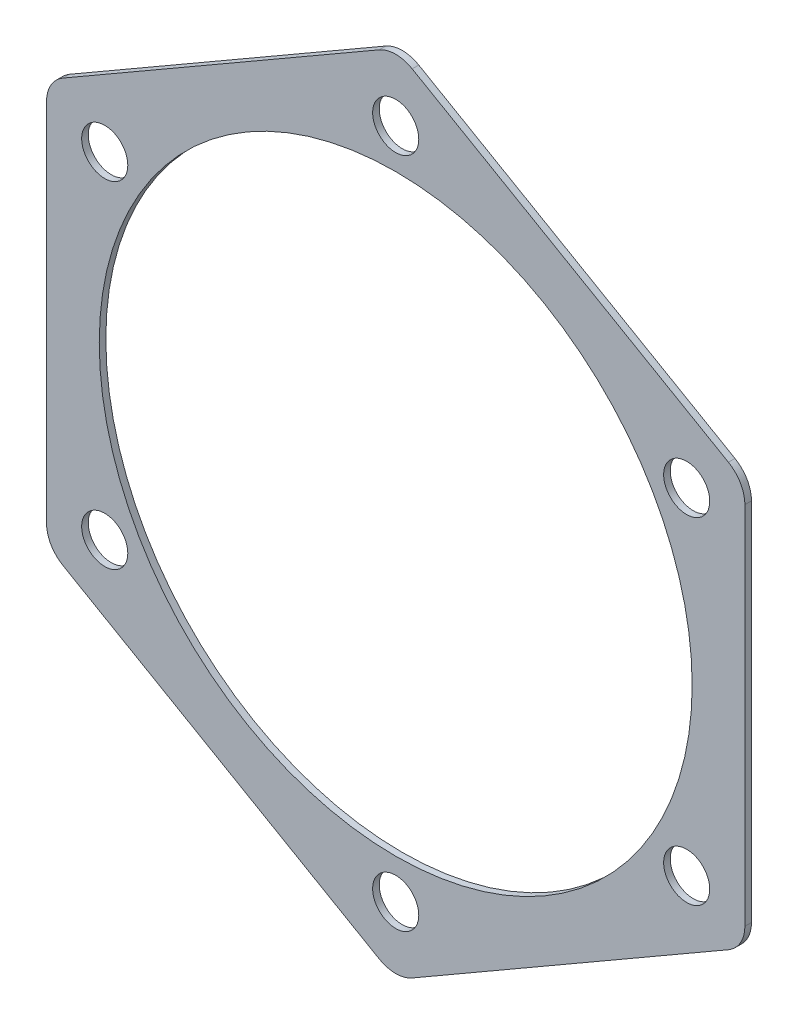
ISO-10303-21;
HEADER;
FILE_DESCRIPTION(('STEP AP214'),'2;1');
FILE_NAME('part.step','',(''),(''),'','','');
FILE_SCHEMA(('AUTOMOTIVE_DESIGN { 1 0 10303 214 1 1 1 1 }'));
ENDSEC;
DATA;
#1=APPLICATION_CONTEXT('core data for automotive mechanical design processes');
#2=APPLICATION_PROTOCOL_DEFINITION('international standard','automotive_design',2000,#1);
#3=PRODUCT_CONTEXT('',#1,'mechanical');
#4=PRODUCT('Part','Part','',(#3));
#5=PRODUCT_RELATED_PRODUCT_CATEGORY('part','',(#4));
#6=PRODUCT_DEFINITION_FORMATION('','',#4);
#7=PRODUCT_DEFINITION_CONTEXT('part definition',#1,'design');
#8=PRODUCT_DEFINITION('design','',#6,#7);
#9=PRODUCT_DEFINITION_SHAPE('','',#8);
#10=(LENGTH_UNIT() NAMED_UNIT(*) SI_UNIT(.MILLI.,.METRE.));
#11=(NAMED_UNIT(*) PLANE_ANGLE_UNIT() SI_UNIT($,.RADIAN.));
#12=(NAMED_UNIT(*) SI_UNIT($,.STERADIAN.) SOLID_ANGLE_UNIT());
#13=UNCERTAINTY_MEASURE_WITH_UNIT(LENGTH_MEASURE(1.E-05),#10,'distance_accuracy_value','');
#14=(GEOMETRIC_REPRESENTATION_CONTEXT(3) GLOBAL_UNCERTAINTY_ASSIGNED_CONTEXT((#13)) GLOBAL_UNIT_ASSIGNED_CONTEXT((#10,
#11,#12)) REPRESENTATION_CONTEXT('',''));
#15=CARTESIAN_POINT('',(0.,0.,0.));
#16=DIRECTION('',(0.,0.,1.));
#17=DIRECTION('',(1.,0.,0.));
#18=AXIS2_PLACEMENT_3D('',#15,#16,#17);
#19=CARTESIAN_POINT('',(-48.,-27.712812921102,1.));
#20=DIRECTION('',(0.,0.,-1.));
#21=DIRECTION('',(-1.,0.,0.));
#22=AXIS2_PLACEMENT_3D('',#19,#20,#21);
#23=PLANE('',#22);
#24=CARTESIAN_POINT('',(-48.,-27.712812921102,1.));
#25=DIRECTION('',(0.,0.,1.));
#26=DIRECTION('',(-1.,0.,0.));
#27=AXIS2_PLACEMENT_3D('',#24,#25,#26);
#28=CIRCLE('',#27,5.);
#29=CARTESIAN_POINT('',(-53.,-27.712812921102,1.));
#30=VERTEX_POINT('',#29);
#31=CARTESIAN_POINT('',(-50.5,-32.0429399400242,1.));
#32=VERTEX_POINT('',#31);
#33=EDGE_CURVE('E200',#30,#32,#28,.T.);
#34=ORIENTED_EDGE('',*,*,#33,.T.);
#35=DIRECTION('',(0.866025403784439,-0.5,0.));
#36=VECTOR('',#35,1.);
#37=CARTESIAN_POINT('',(-50.5,-32.0429399400242,1.));
#38=LINE('',#37,#36);
#39=CARTESIAN_POINT('',(-2.49999999999997,-59.7557528611262,1.));
#40=VERTEX_POINT('',#39);
#41=EDGE_CURVE('E112',#32,#40,#38,.T.);
#42=ORIENTED_EDGE('',*,*,#41,.T.);
#43=CARTESIAN_POINT('',(0.,-55.4256258422041,1.));
#44=DIRECTION('',(0.,0.,1.));
#45=DIRECTION('',(1.,0.,0.));
#46=AXIS2_PLACEMENT_3D('',#43,#44,#45);
#47=CIRCLE('',#46,5.);
#48=CARTESIAN_POINT('',(2.50000000000007,-59.7557528611262,1.));
#49=VERTEX_POINT('',#48);
#50=EDGE_CURVE('E237',#40,#49,#47,.T.);
#51=ORIENTED_EDGE('',*,*,#50,.T.);
#52=DIRECTION('',(0.866025403784438,0.5,0.));
#53=VECTOR('',#52,1.);
#54=CARTESIAN_POINT('',(2.50000000000007,-59.7557528611262,1.));
#55=LINE('',#54,#53);
#56=CARTESIAN_POINT('',(50.5,-32.0429399400242,1.));
#57=VERTEX_POINT('',#56);
#58=EDGE_CURVE('E257',#49,#57,#55,.T.);
#59=ORIENTED_EDGE('',*,*,#58,.T.);
#60=CARTESIAN_POINT('',(48.,-27.712812921102,1.));
#61=DIRECTION('',(0.,0.,1.));
#62=DIRECTION('',(1.,0.,0.));
#63=AXIS2_PLACEMENT_3D('',#60,#61,#62);
#64=CIRCLE('',#63,5.);
#65=CARTESIAN_POINT('',(53.,-27.712812921102,1.));
#66=VERTEX_POINT('',#65);
#67=EDGE_CURVE('E253',#57,#66,#64,.T.);
#68=ORIENTED_EDGE('',*,*,#67,.T.);
#69=DIRECTION('',(0.,1.,0.));
#70=VECTOR('',#69,1.);
#71=CARTESIAN_POINT('',(53.,-27.712812921102,1.));
#72=LINE('',#71,#70);
#73=CARTESIAN_POINT('',(53.,27.712812921102,1.));
#74=VERTEX_POINT('',#73);
#75=EDGE_CURVE('E256',#66,#74,#72,.T.);
#76=ORIENTED_EDGE('',*,*,#75,.T.);
#77=CARTESIAN_POINT('',(48.,27.7128129211021,1.));
#78=DIRECTION('',(0.,0.,1.));
#79=DIRECTION('',(1.,0.,0.));
#80=AXIS2_PLACEMENT_3D('',#77,#78,#79);
#81=CIRCLE('',#80,5.);
#82=CARTESIAN_POINT('',(50.5,32.0429399400243,1.));
#83=VERTEX_POINT('',#82);
#84=EDGE_CURVE('E261',#74,#83,#81,.T.);
#85=ORIENTED_EDGE('',*,*,#84,.T.);
#86=DIRECTION('',(-0.866025403784438,0.5,0.));
#87=VECTOR('',#86,1.);
#88=CARTESIAN_POINT('',(50.5,32.0429399400243,1.));
#89=LINE('',#88,#87);
#90=CARTESIAN_POINT('',(2.50000000000003,59.7557528611263,1.));
#91=VERTEX_POINT('',#90);
#92=EDGE_CURVE('E268',#83,#91,#89,.T.);
#93=ORIENTED_EDGE('',*,*,#92,.T.);
#94=CARTESIAN_POINT('',(0.,55.4256258422041,1.));
#95=DIRECTION('',(0.,0.,1.));
#96=DIRECTION('',(1.,0.,0.));
#97=AXIS2_PLACEMENT_3D('',#94,#95,#96);
#98=CIRCLE('',#97,5.);
#99=CARTESIAN_POINT('',(-2.50000000000001,59.7557528611263,1.));
#100=VERTEX_POINT('',#99);
#101=EDGE_CURVE('E143',#91,#100,#98,.T.);
#102=ORIENTED_EDGE('',*,*,#101,.T.);
#103=DIRECTION('',(-0.866025403784439,-0.5,0.));
#104=VECTOR('',#103,1.);
#105=CARTESIAN_POINT('',(-2.50000000000001,59.7557528611263,1.));
#106=LINE('',#105,#104);
#107=CARTESIAN_POINT('',(-50.5,32.0429399400242,1.));
#108=VERTEX_POINT('',#107);
#109=EDGE_CURVE('E137',#100,#108,#106,.T.);
#110=ORIENTED_EDGE('',*,*,#109,.T.);
#111=CARTESIAN_POINT('',(-48.,27.712812921102,1.));
#112=DIRECTION('',(0.,0.,1.));
#113=DIRECTION('',(1.,0.,0.));
#114=AXIS2_PLACEMENT_3D('',#111,#112,#113);
#115=CIRCLE('',#114,5.);
#116=CARTESIAN_POINT('',(-53.,27.712812921102,1.));
#117=VERTEX_POINT('',#116);
#118=EDGE_CURVE('E141',#108,#117,#115,.T.);
#119=ORIENTED_EDGE('',*,*,#118,.T.);
#120=DIRECTION('',(0.,-1.,0.));
#121=VECTOR('',#120,1.);
#122=CARTESIAN_POINT('',(-53.,27.712812921102,1.));
#123=LINE('',#122,#121);
#124=EDGE_CURVE('E57',#117,#30,#123,.T.);
#125=ORIENTED_EDGE('',*,*,#124,.T.);
#126=EDGE_LOOP('',(#34,#42,#51,#59,#68,#76,#85,#93,#102,#110,#119,#125));
#127=FACE_BOUND('',#126,.T.);
#128=CARTESIAN_POINT('',(0.,0.,1.));
#129=DIRECTION('',(0.,0.,1.));
#130=DIRECTION('',(1.,0.,0.));
#131=AXIS2_PLACEMENT_3D('',#128,#129,#130);
#132=CIRCLE('',#131,45.);
#133=CARTESIAN_POINT('',(45.,0.,1.));
#134=VERTEX_POINT('',#133);
#135=EDGE_CURVE('E170',#134,#134,#132,.T.);
#136=ORIENTED_EDGE('',*,*,#135,.F.);
#137=EDGE_LOOP('',(#136));
#138=FACE_BOUND('',#137,.T.);
#139=CARTESIAN_POINT('',(0.,51.,1.));
#140=DIRECTION('',(0.,0.,1.));
#141=DIRECTION('',(1.,0.,0.));
#142=AXIS2_PLACEMENT_3D('',#139,#140,#141);
#143=CIRCLE('',#142,3.5);
#144=CARTESIAN_POINT('',(3.5,51.,1.));
#145=VERTEX_POINT('',#144);
#146=EDGE_CURVE('E374',#145,#145,#143,.T.);
#147=ORIENTED_EDGE('',*,*,#146,.F.);
#148=EDGE_LOOP('',(#147));
#149=FACE_BOUND('',#148,.T.);
#150=CARTESIAN_POINT('',(44.1672955930074,25.5000000000019,1.));
#151=DIRECTION('',(0.,0.,1.));
#152=DIRECTION('',(1.,0.,0.));
#153=AXIS2_PLACEMENT_3D('',#150,#151,#152);
#154=CIRCLE('',#153,3.50000000000063);
#155=CARTESIAN_POINT('',(47.6672955930081,25.5000000000019,1.));
#156=VERTEX_POINT('',#155);
#157=EDGE_CURVE('E366',#156,#156,#154,.T.);
#158=ORIENTED_EDGE('',*,*,#157,.F.);
#159=EDGE_LOOP('',(#158));
#160=FACE_BOUND('',#159,.T.);
#161=CARTESIAN_POINT('',(44.1672955930096,-25.4999999999981,1.));
#162=DIRECTION('',(0.,0.,1.));
#163=DIRECTION('',(1.,0.,0.));
#164=AXIS2_PLACEMENT_3D('',#161,#162,#163);
#165=CIRCLE('',#164,3.50000000000279);
#166=CARTESIAN_POINT('',(47.6672955930124,-25.4999999999981,1.));
#167=VERTEX_POINT('',#166);
#168=EDGE_CURVE('E358',#167,#167,#165,.T.);
#169=ORIENTED_EDGE('',*,*,#168,.F.);
#170=EDGE_LOOP('',(#169));
#171=FACE_BOUND('',#170,.T.);
#172=CARTESIAN_POINT('',(4.32978444682486E-12,-51.,1.));
#173=DIRECTION('',(0.,0.,1.));
#174=DIRECTION('',(1.,0.,0.));
#175=AXIS2_PLACEMENT_3D('',#172,#173,#174);
#176=CIRCLE('',#175,3.50000000000448);
#177=CARTESIAN_POINT('',(3.50000000000881,-51.,1.));
#178=VERTEX_POINT('',#177);
#179=EDGE_CURVE('E350',#178,#178,#176,.T.);
#180=ORIENTED_EDGE('',*,*,#179,.F.);
#181=EDGE_LOOP('',(#180));
#182=FACE_BOUND('',#181,.T.);
#183=CARTESIAN_POINT('',(-44.1672955930031,-25.5000000000019,1.));
#184=DIRECTION('',(0.,0.,1.));
#185=DIRECTION('',(1.,0.,0.));
#186=AXIS2_PLACEMENT_3D('',#183,#184,#185);
#187=CIRCLE('',#186,3.50000000000413);
#188=CARTESIAN_POINT('',(-40.667295592999,-25.5000000000019,1.));
#189=VERTEX_POINT('',#188);
#190=EDGE_CURVE('E342',#189,#189,#187,.T.);
#191=ORIENTED_EDGE('',*,*,#190,.F.);
#192=EDGE_LOOP('',(#191));
#193=FACE_BOUND('',#192,.T.);
#194=CARTESIAN_POINT('',(-44.1672955930053,25.4999999999981,1.));
#195=DIRECTION('',(0.,0.,1.));
#196=DIRECTION('',(1.,0.,0.));
#197=AXIS2_PLACEMENT_3D('',#194,#195,#196);
#198=CIRCLE('',#197,3.50000000000219);
#199=CARTESIAN_POINT('',(-40.6672955930031,25.4999999999981,1.));
#200=VERTEX_POINT('',#199);
#201=EDGE_CURVE('E331',#200,#200,#198,.T.);
#202=ORIENTED_EDGE('',*,*,#201,.F.);
#203=EDGE_LOOP('',(#202));
#204=FACE_BOUND('',#203,.T.);
#205=ADVANCED_FACE('F39',(#127,#138,#149,#160,#171,#182,#193,#204),#23,.F.);
#206=CARTESIAN_POINT('',(-48.,-27.712812921102,0.));
#207=DIRECTION('',(0.,0.,-1.));
#208=DIRECTION('',(-1.,0.,0.));
#209=AXIS2_PLACEMENT_3D('',#206,#207,#208);
#210=PLANE('',#209);
#211=CARTESIAN_POINT('',(-44.1672955930031,-25.5000000000019,0.));
#212=DIRECTION('',(0.,0.,1.));
#213=DIRECTION('',(1.,0.,0.));
#214=AXIS2_PLACEMENT_3D('',#211,#212,#213);
#215=CIRCLE('',#214,3.50000000000413);
#216=CARTESIAN_POINT('',(-40.667295592999,-25.5000000000019,0.));
#217=VERTEX_POINT('',#216);
#218=EDGE_CURVE('E339',#217,#217,#215,.T.);
#219=ORIENTED_EDGE('',*,*,#218,.T.);
#220=EDGE_LOOP('',(#219));
#221=FACE_BOUND('',#220,.T.);
#222=CARTESIAN_POINT('',(44.1672955930096,-25.4999999999981,0.));
#223=DIRECTION('',(0.,0.,1.));
#224=DIRECTION('',(1.,0.,0.));
#225=AXIS2_PLACEMENT_3D('',#222,#223,#224);
#226=CIRCLE('',#225,3.50000000000279);
#227=CARTESIAN_POINT('',(47.6672955930124,-25.4999999999981,0.));
#228=VERTEX_POINT('',#227);
#229=EDGE_CURVE('E354',#228,#228,#226,.T.);
#230=ORIENTED_EDGE('',*,*,#229,.T.);
#231=EDGE_LOOP('',(#230));
#232=FACE_BOUND('',#231,.T.);
#233=CARTESIAN_POINT('',(0.,51.,0.));
#234=DIRECTION('',(0.,0.,1.));
#235=DIRECTION('',(1.,0.,0.));
#236=AXIS2_PLACEMENT_3D('',#233,#234,#235);
#237=CIRCLE('',#236,3.5);
#238=CARTESIAN_POINT('',(3.5,51.,0.));
#239=VERTEX_POINT('',#238);
#240=EDGE_CURVE('E370',#239,#239,#237,.T.);
#241=ORIENTED_EDGE('',*,*,#240,.T.);
#242=EDGE_LOOP('',(#241));
#243=FACE_BOUND('',#242,.T.);
#244=CARTESIAN_POINT('',(-48.,-27.712812921102,0.));
#245=DIRECTION('',(0.,0.,1.));
#246=DIRECTION('',(-1.,0.,0.));
#247=AXIS2_PLACEMENT_3D('',#244,#245,#246);
#248=CIRCLE('',#247,5.);
#249=CARTESIAN_POINT('',(-53.,-27.712812921102,0.));
#250=VERTEX_POINT('',#249);
#251=CARTESIAN_POINT('',(-50.5,-32.0429399400242,0.));
#252=VERTEX_POINT('',#251);
#253=EDGE_CURVE('E165',#250,#252,#248,.T.);
#254=ORIENTED_EDGE('',*,*,#253,.F.);
#255=DIRECTION('',(0.,-1.,0.));
#256=VECTOR('',#255,1.);
#257=CARTESIAN_POINT('',(-53.,27.712812921102,0.));
#258=LINE('',#257,#256);
#259=CARTESIAN_POINT('',(-53.,27.712812921102,0.));
#260=VERTEX_POINT('',#259);
#261=EDGE_CURVE('E104',#260,#250,#258,.T.);
#262=ORIENTED_EDGE('',*,*,#261,.F.);
#263=CARTESIAN_POINT('',(-48.,27.712812921102,0.));
#264=DIRECTION('',(0.,0.,1.));
#265=DIRECTION('',(1.,0.,0.));
#266=AXIS2_PLACEMENT_3D('',#263,#264,#265);
#267=CIRCLE('',#266,5.);
#268=CARTESIAN_POINT('',(-50.5,32.0429399400242,0.));
#269=VERTEX_POINT('',#268);
#270=EDGE_CURVE('E98',#269,#260,#267,.T.);
#271=ORIENTED_EDGE('',*,*,#270,.F.);
#272=DIRECTION('',(-0.866025403784439,-0.5,0.));
#273=VECTOR('',#272,1.);
#274=CARTESIAN_POINT('',(-2.50000000000001,59.7557528611263,0.));
#275=LINE('',#274,#273);
#276=CARTESIAN_POINT('',(-2.50000000000001,59.7557528611263,0.));
#277=VERTEX_POINT('',#276);
#278=EDGE_CURVE('E152',#277,#269,#275,.T.);
#279=ORIENTED_EDGE('',*,*,#278,.F.);
#280=CARTESIAN_POINT('',(0.,55.4256258422041,0.));
#281=DIRECTION('',(0.,0.,1.));
#282=DIRECTION('',(1.,0.,0.));
#283=AXIS2_PLACEMENT_3D('',#280,#281,#282);
#284=CIRCLE('',#283,5.);
#285=CARTESIAN_POINT('',(2.50000000000003,59.7557528611263,0.));
#286=VERTEX_POINT('',#285);
#287=EDGE_CURVE('E191',#286,#277,#284,.T.);
#288=ORIENTED_EDGE('',*,*,#287,.F.);
#289=DIRECTION('',(-0.866025403784438,0.5,0.));
#290=VECTOR('',#289,1.);
#291=CARTESIAN_POINT('',(50.5,32.0429399400243,0.));
#292=LINE('',#291,#290);
#293=CARTESIAN_POINT('',(50.5,32.0429399400243,0.));
#294=VERTEX_POINT('',#293);
#295=EDGE_CURVE('E188',#294,#286,#292,.T.);
#296=ORIENTED_EDGE('',*,*,#295,.F.);
#297=CARTESIAN_POINT('',(48.,27.7128129211021,0.));
#298=DIRECTION('',(0.,0.,1.));
#299=DIRECTION('',(1.,0.,0.));
#300=AXIS2_PLACEMENT_3D('',#297,#298,#299);
#301=CIRCLE('',#300,5.);
#302=CARTESIAN_POINT('',(53.,27.712812921102,0.));
#303=VERTEX_POINT('',#302);
#304=EDGE_CURVE('E185',#303,#294,#301,.T.);
#305=ORIENTED_EDGE('',*,*,#304,.F.);
#306=DIRECTION('',(0.,1.,0.));
#307=VECTOR('',#306,1.);
#308=CARTESIAN_POINT('',(53.,-27.712812921102,0.));
#309=LINE('',#308,#307);
#310=CARTESIAN_POINT('',(53.,-27.712812921102,0.));
#311=VERTEX_POINT('',#310);
#312=EDGE_CURVE('E182',#311,#303,#309,.T.);
#313=ORIENTED_EDGE('',*,*,#312,.F.);
#314=CARTESIAN_POINT('',(48.,-27.712812921102,0.));
#315=DIRECTION('',(0.,0.,1.));
#316=DIRECTION('',(1.,0.,0.));
#317=AXIS2_PLACEMENT_3D('',#314,#315,#316);
#318=CIRCLE('',#317,5.);
#319=CARTESIAN_POINT('',(50.5,-32.0429399400242,0.));
#320=VERTEX_POINT('',#319);
#321=EDGE_CURVE('E179',#320,#311,#318,.T.);
#322=ORIENTED_EDGE('',*,*,#321,.F.);
#323=DIRECTION('',(0.866025403784438,0.5,0.));
#324=VECTOR('',#323,1.);
#325=CARTESIAN_POINT('',(2.50000000000007,-59.7557528611262,0.));
#326=LINE('',#325,#324);
#327=CARTESIAN_POINT('',(2.50000000000007,-59.7557528611262,0.));
#328=VERTEX_POINT('',#327);
#329=EDGE_CURVE('E176',#328,#320,#326,.T.);
#330=ORIENTED_EDGE('',*,*,#329,.F.);
#331=CARTESIAN_POINT('',(0.,-55.4256258422041,0.));
#332=DIRECTION('',(0.,0.,1.));
#333=DIRECTION('',(1.,0.,0.));
#334=AXIS2_PLACEMENT_3D('',#331,#332,#333);
#335=CIRCLE('',#334,5.);
#336=CARTESIAN_POINT('',(-2.49999999999997,-59.7557528611262,0.));
#337=VERTEX_POINT('',#336);
#338=EDGE_CURVE('E173',#337,#328,#335,.T.);
#339=ORIENTED_EDGE('',*,*,#338,.F.);
#340=DIRECTION('',(0.866025403784439,-0.5,0.));
#341=VECTOR('',#340,1.);
#342=CARTESIAN_POINT('',(-50.5,-32.0429399400242,0.));
#343=LINE('',#342,#341);
#344=EDGE_CURVE('E169',#252,#337,#343,.T.);
#345=ORIENTED_EDGE('',*,*,#344,.F.);
#346=EDGE_LOOP('',(#254,#262,#271,#279,#288,#296,#305,#313,#322,#330,#339,#345));
#347=FACE_BOUND('',#346,.T.);
#348=CARTESIAN_POINT('',(0.,0.,0.));
#349=DIRECTION('',(0.,0.,1.));
#350=DIRECTION('',(1.,0.,0.));
#351=AXIS2_PLACEMENT_3D('',#348,#349,#350);
#352=CIRCLE('',#351,45.);
#353=CARTESIAN_POINT('',(45.,0.,0.));
#354=VERTEX_POINT('',#353);
#355=EDGE_CURVE('E378',#354,#354,#352,.T.);
#356=ORIENTED_EDGE('',*,*,#355,.T.);
#357=EDGE_LOOP('',(#356));
#358=FACE_BOUND('',#357,.T.);
#359=CARTESIAN_POINT('',(44.1672955930074,25.5000000000019,0.));
#360=DIRECTION('',(0.,0.,1.));
#361=DIRECTION('',(1.,0.,0.));
#362=AXIS2_PLACEMENT_3D('',#359,#360,#361);
#363=CIRCLE('',#362,3.50000000000063);
#364=CARTESIAN_POINT('',(47.6672955930081,25.5000000000019,0.));
#365=VERTEX_POINT('',#364);
#366=EDGE_CURVE('E362',#365,#365,#363,.T.);
#367=ORIENTED_EDGE('',*,*,#366,.T.);
#368=EDGE_LOOP('',(#367));
#369=FACE_BOUND('',#368,.T.);
#370=CARTESIAN_POINT('',(4.32978444682486E-12,-51.,0.));
#371=DIRECTION('',(0.,0.,1.));
#372=DIRECTION('',(1.,0.,0.));
#373=AXIS2_PLACEMENT_3D('',#370,#371,#372);
#374=CIRCLE('',#373,3.50000000000448);
#375=CARTESIAN_POINT('',(3.50000000000881,-51.,0.));
#376=VERTEX_POINT('',#375);
#377=EDGE_CURVE('E346',#376,#376,#374,.T.);
#378=ORIENTED_EDGE('',*,*,#377,.T.);
#379=EDGE_LOOP('',(#378));
#380=FACE_BOUND('',#379,.T.);
#381=CARTESIAN_POINT('',(-44.1672955930053,25.4999999999981,0.));
#382=DIRECTION('',(0.,0.,1.));
#383=DIRECTION('',(1.,0.,0.));
#384=AXIS2_PLACEMENT_3D('',#381,#382,#383);
#385=CIRCLE('',#384,3.50000000000219);
#386=CARTESIAN_POINT('',(-40.6672955930031,25.4999999999981,0.));
#387=VERTEX_POINT('',#386);
#388=EDGE_CURVE('E334',#387,#387,#385,.T.);
#389=ORIENTED_EDGE('',*,*,#388,.T.);
#390=EDGE_LOOP('',(#389));
#391=FACE_BOUND('',#390,.T.);
#392=ADVANCED_FACE('F241',(#221,#232,#243,#347,#358,#369,#380,#391),#210,.T.);
#393=CARTESIAN_POINT('',(-48.,-27.712812921102,1.));
#394=DIRECTION('',(0.,0.,-1.));
#395=DIRECTION('',(-1.,0.,0.));
#396=AXIS2_PLACEMENT_3D('',#393,#394,#395);
#397=CYLINDRICAL_SURFACE('',#396,5.);
#398=ORIENTED_EDGE('',*,*,#253,.T.);
#399=DIRECTION('',(0.,0.,-1.));
#400=VECTOR('',#399,1.);
#401=CARTESIAN_POINT('',(-50.5,-32.0429399400242,1.));
#402=LINE('',#401,#400);
#403=EDGE_CURVE('E11',#32,#252,#402,.T.);
#404=ORIENTED_EDGE('',*,*,#403,.F.);
#405=ORIENTED_EDGE('',*,*,#33,.F.);
#406=DIRECTION('',(0.,0.,-1.));
#407=VECTOR('',#406,1.);
#408=CARTESIAN_POINT('',(-53.,-27.712812921102,1.));
#409=LINE('',#408,#407);
#410=EDGE_CURVE('E161',#30,#250,#409,.T.);
#411=ORIENTED_EDGE('',*,*,#410,.T.);
#412=EDGE_LOOP('',(#398,#404,#405,#411));
#413=FACE_BOUND('',#412,.T.);
#414=ADVANCED_FACE('F41',(#413),#397,.T.);
#415=CARTESIAN_POINT('',(-50.5,-32.0429399400242,1.));
#416=DIRECTION('',(0.5,0.866025403784439,0.));
#417=DIRECTION('',(-0.866025403784439,0.5,0.));
#418=AXIS2_PLACEMENT_3D('',#415,#416,#417);
#419=PLANE('',#418);
#420=ORIENTED_EDGE('',*,*,#344,.T.);
#421=DIRECTION('',(0.,0.,-1.));
#422=VECTOR('',#421,1.);
#423=CARTESIAN_POINT('',(-2.49999999999997,-59.7557528611262,1.));
#424=LINE('',#423,#422);
#425=EDGE_CURVE('E49',#40,#337,#424,.T.);
#426=ORIENTED_EDGE('',*,*,#425,.F.);
#427=ORIENTED_EDGE('',*,*,#41,.F.);
#428=ORIENTED_EDGE('',*,*,#403,.T.);
#429=EDGE_LOOP('',(#420,#426,#427,#428));
#430=FACE_BOUND('',#429,.T.);
#431=ADVANCED_FACE('F523',(#430),#419,.F.);
#432=CARTESIAN_POINT('',(0.,-55.4256258422041,1.));
#433=DIRECTION('',(0.,0.,-1.));
#434=DIRECTION('',(-1.,0.,0.));
#435=AXIS2_PLACEMENT_3D('',#432,#433,#434);
#436=CYLINDRICAL_SURFACE('',#435,5.);
#437=ORIENTED_EDGE('',*,*,#338,.T.);
#438=DIRECTION('',(0.,0.,-1.));
#439=VECTOR('',#438,1.);
#440=CARTESIAN_POINT('',(2.50000000000007,-59.7557528611262,1.));
#441=LINE('',#440,#439);
#442=EDGE_CURVE('E227',#49,#328,#441,.T.);
#443=ORIENTED_EDGE('',*,*,#442,.F.);
#444=ORIENTED_EDGE('',*,*,#50,.F.);
#445=ORIENTED_EDGE('',*,*,#425,.T.);
#446=EDGE_LOOP('',(#437,#443,#444,#445));
#447=FACE_BOUND('',#446,.T.);
#448=ADVANCED_FACE('F235',(#447),#436,.T.);
#449=CARTESIAN_POINT('',(2.50000000000007,-59.7557528611262,1.));
#450=DIRECTION('',(-0.5,0.866025403784439,0.));
#451=DIRECTION('',(-0.866025403784439,-0.5,0.));
#452=AXIS2_PLACEMENT_3D('',#449,#450,#451);
#453=PLANE('',#452);
#454=ORIENTED_EDGE('',*,*,#329,.T.);
#455=DIRECTION('',(0.,0.,-1.));
#456=VECTOR('',#455,1.);
#457=CARTESIAN_POINT('',(50.5,-32.0429399400242,1.));
#458=LINE('',#457,#456);
#459=EDGE_CURVE('E223',#57,#320,#458,.T.);
#460=ORIENTED_EDGE('',*,*,#459,.F.);
#461=ORIENTED_EDGE('',*,*,#58,.F.);
#462=ORIENTED_EDGE('',*,*,#442,.T.);
#463=EDGE_LOOP('',(#454,#460,#461,#462));
#464=FACE_BOUND('',#463,.T.);
#465=ADVANCED_FACE('F247',(#464),#453,.F.);
#466=CARTESIAN_POINT('',(48.,-27.712812921102,1.));
#467=DIRECTION('',(0.,0.,-1.));
#468=DIRECTION('',(-1.,0.,0.));
#469=AXIS2_PLACEMENT_3D('',#466,#467,#468);
#470=CYLINDRICAL_SURFACE('',#469,5.);
#471=ORIENTED_EDGE('',*,*,#321,.T.);
#472=DIRECTION('',(0.,0.,-1.));
#473=VECTOR('',#472,1.);
#474=CARTESIAN_POINT('',(53.,-27.712812921102,1.));
#475=LINE('',#474,#473);
#476=EDGE_CURVE('E219',#66,#311,#475,.T.);
#477=ORIENTED_EDGE('',*,*,#476,.F.);
#478=ORIENTED_EDGE('',*,*,#67,.F.);
#479=ORIENTED_EDGE('',*,*,#459,.T.);
#480=EDGE_LOOP('',(#471,#477,#478,#479));
#481=FACE_BOUND('',#480,.T.);
#482=ADVANCED_FACE('F251',(#481),#470,.T.);
#483=CARTESIAN_POINT('',(53.,-27.712812921102,1.));
#484=DIRECTION('',(-1.,0.,0.));
#485=DIRECTION('',(0.,-1.,0.));
#486=AXIS2_PLACEMENT_3D('',#483,#484,#485);
#487=PLANE('',#486);
#488=ORIENTED_EDGE('',*,*,#312,.T.);
#489=DIRECTION('',(0.,0.,-1.));
#490=VECTOR('',#489,1.);
#491=CARTESIAN_POINT('',(53.,27.712812921102,1.));
#492=LINE('',#491,#490);
#493=EDGE_CURVE('E215',#74,#303,#492,.T.);
#494=ORIENTED_EDGE('',*,*,#493,.F.);
#495=ORIENTED_EDGE('',*,*,#75,.F.);
#496=ORIENTED_EDGE('',*,*,#476,.T.);
#497=EDGE_LOOP('',(#488,#494,#495,#496));
#498=FACE_BOUND('',#497,.T.);
#499=ADVANCED_FACE('F488',(#498),#487,.F.);
#500=CARTESIAN_POINT('',(48.,27.7128129211021,1.));
#501=DIRECTION('',(0.,0.,-1.));
#502=DIRECTION('',(-1.,0.,0.));
#503=AXIS2_PLACEMENT_3D('',#500,#501,#502);
#504=CYLINDRICAL_SURFACE('',#503,5.);
#505=ORIENTED_EDGE('',*,*,#304,.T.);
#506=DIRECTION('',(0.,0.,-1.));
#507=VECTOR('',#506,1.);
#508=CARTESIAN_POINT('',(50.5,32.0429399400243,1.));
#509=LINE('',#508,#507);
#510=EDGE_CURVE('E211',#83,#294,#509,.T.);
#511=ORIENTED_EDGE('',*,*,#510,.F.);
#512=ORIENTED_EDGE('',*,*,#84,.F.);
#513=ORIENTED_EDGE('',*,*,#493,.T.);
#514=EDGE_LOOP('',(#505,#511,#512,#513));
#515=FACE_BOUND('',#514,.T.);
#516=ADVANCED_FACE('F479',(#515),#504,.T.);
#517=CARTESIAN_POINT('',(50.5,32.0429399400243,1.));
#518=DIRECTION('',(-0.5,-0.866025403784439,0.));
#519=DIRECTION('',(0.866025403784439,-0.5,0.));
#520=AXIS2_PLACEMENT_3D('',#517,#518,#519);
#521=PLANE('',#520);
#522=ORIENTED_EDGE('',*,*,#295,.T.);
#523=DIRECTION('',(0.,0.,-1.));
#524=VECTOR('',#523,1.);
#525=CARTESIAN_POINT('',(2.50000000000003,59.7557528611263,1.));
#526=LINE('',#525,#524);
#527=EDGE_CURVE('E207',#91,#286,#526,.T.);
#528=ORIENTED_EDGE('',*,*,#527,.F.);
#529=ORIENTED_EDGE('',*,*,#92,.F.);
#530=ORIENTED_EDGE('',*,*,#510,.T.);
#531=EDGE_LOOP('',(#522,#528,#529,#530));
#532=FACE_BOUND('',#531,.T.);
#533=ADVANCED_FACE('F276',(#532),#521,.F.);
#534=CARTESIAN_POINT('',(0.,55.4256258422041,1.));
#535=DIRECTION('',(0.,0.,-1.));
#536=DIRECTION('',(-1.,0.,0.));
#537=AXIS2_PLACEMENT_3D('',#534,#535,#536);
#538=CYLINDRICAL_SURFACE('',#537,5.);
#539=ORIENTED_EDGE('',*,*,#287,.T.);
#540=DIRECTION('',(0.,0.,-1.));
#541=VECTOR('',#540,1.);
#542=CARTESIAN_POINT('',(-2.50000000000001,59.7557528611263,1.));
#543=LINE('',#542,#541);
#544=EDGE_CURVE('E154',#100,#277,#543,.T.);
#545=ORIENTED_EDGE('',*,*,#544,.F.);
#546=ORIENTED_EDGE('',*,*,#101,.F.);
#547=ORIENTED_EDGE('',*,*,#527,.T.);
#548=EDGE_LOOP('',(#539,#545,#546,#547));
#549=FACE_BOUND('',#548,.T.);
#550=ADVANCED_FACE('F280',(#549),#538,.T.);
#551=CARTESIAN_POINT('',(-2.50000000000001,59.7557528611263,1.));
#552=DIRECTION('',(0.5,-0.866025403784439,0.));
#553=DIRECTION('',(0.866025403784439,0.5,0.));
#554=AXIS2_PLACEMENT_3D('',#551,#552,#553);
#555=PLANE('',#554);
#556=ORIENTED_EDGE('',*,*,#278,.T.);
#557=DIRECTION('',(0.,0.,-1.));
#558=VECTOR('',#557,1.);
#559=CARTESIAN_POINT('',(-50.5,32.0429399400242,1.));
#560=LINE('',#559,#558);
#561=EDGE_CURVE('E149',#108,#269,#560,.T.);
#562=ORIENTED_EDGE('',*,*,#561,.F.);
#563=ORIENTED_EDGE('',*,*,#109,.F.);
#564=ORIENTED_EDGE('',*,*,#544,.T.);
#565=EDGE_LOOP('',(#556,#562,#563,#564));
#566=FACE_BOUND('',#565,.T.);
#567=ADVANCED_FACE('F150',(#566),#555,.F.);
#568=CARTESIAN_POINT('',(-48.,27.712812921102,1.));
#569=DIRECTION('',(0.,0.,-1.));
#570=DIRECTION('',(-1.,0.,0.));
#571=AXIS2_PLACEMENT_3D('',#568,#569,#570);
#572=CYLINDRICAL_SURFACE('',#571,5.);
#573=ORIENTED_EDGE('',*,*,#270,.T.);
#574=DIRECTION('',(0.,0.,-1.));
#575=VECTOR('',#574,1.);
#576=CARTESIAN_POINT('',(-53.,27.712812921102,1.));
#577=LINE('',#576,#575);
#578=EDGE_CURVE('E155',#117,#260,#577,.T.);
#579=ORIENTED_EDGE('',*,*,#578,.F.);
#580=ORIENTED_EDGE('',*,*,#118,.F.);
#581=ORIENTED_EDGE('',*,*,#561,.T.);
#582=EDGE_LOOP('',(#573,#579,#580,#581));
#583=FACE_BOUND('',#582,.T.);
#584=ADVANCED_FACE('F157',(#583),#572,.T.);
#585=CARTESIAN_POINT('',(-53.,27.712812921102,1.));
#586=DIRECTION('',(1.,0.,0.));
#587=DIRECTION('',(0.,1.,0.));
#588=AXIS2_PLACEMENT_3D('',#585,#586,#587);
#589=PLANE('',#588);
#590=ORIENTED_EDGE('',*,*,#261,.T.);
#591=ORIENTED_EDGE('',*,*,#410,.F.);
#592=ORIENTED_EDGE('',*,*,#124,.F.);
#593=ORIENTED_EDGE('',*,*,#578,.T.);
#594=EDGE_LOOP('',(#590,#591,#592,#593));
#595=FACE_BOUND('',#594,.T.);
#596=ADVANCED_FACE('F284',(#595),#589,.F.);
#597=CARTESIAN_POINT('',(0.,0.,1.));
#598=DIRECTION('',(0.,0.,-1.));
#599=DIRECTION('',(-1.,0.,0.));
#600=AXIS2_PLACEMENT_3D('',#597,#598,#599);
#601=CYLINDRICAL_SURFACE('',#600,45.);
#602=ORIENTED_EDGE('',*,*,#135,.T.);
#603=EDGE_LOOP('',(#602));
#604=FACE_BOUND('',#603,.T.);
#605=ORIENTED_EDGE('',*,*,#355,.F.);
#606=EDGE_LOOP('',(#605));
#607=FACE_BOUND('',#606,.T.);
#608=ADVANCED_FACE('F286',(#604,#607),#601,.F.);
#609=CARTESIAN_POINT('',(0.,51.,1.));
#610=DIRECTION('',(0.,0.,-1.));
#611=DIRECTION('',(-1.,0.,0.));
#612=AXIS2_PLACEMENT_3D('',#609,#610,#611);
#613=CYLINDRICAL_SURFACE('',#612,3.5);
#614=ORIENTED_EDGE('',*,*,#146,.T.);
#615=EDGE_LOOP('',(#614));
#616=FACE_BOUND('',#615,.T.);
#617=ORIENTED_EDGE('',*,*,#240,.F.);
#618=EDGE_LOOP('',(#617));
#619=FACE_BOUND('',#618,.T.);
#620=ADVANCED_FACE('F292',(#616,#619),#613,.F.);
#621=CARTESIAN_POINT('',(44.1672955930074,25.5000000000019,1.));
#622=DIRECTION('',(0.,0.,-1.));
#623=DIRECTION('',(-1.,0.,0.));
#624=AXIS2_PLACEMENT_3D('',#621,#622,#623);
#625=CYLINDRICAL_SURFACE('',#624,3.50000000000063);
#626=ORIENTED_EDGE('',*,*,#157,.T.);
#627=EDGE_LOOP('',(#626));
#628=FACE_BOUND('',#627,.T.);
#629=ORIENTED_EDGE('',*,*,#366,.F.);
#630=EDGE_LOOP('',(#629));
#631=FACE_BOUND('',#630,.T.);
#632=ADVANCED_FACE('F306',(#628,#631),#625,.F.);
#633=CARTESIAN_POINT('',(44.1672955930096,-25.4999999999981,1.));
#634=DIRECTION('',(0.,0.,-1.));
#635=DIRECTION('',(-1.,0.,0.));
#636=AXIS2_PLACEMENT_3D('',#633,#634,#635);
#637=CYLINDRICAL_SURFACE('',#636,3.50000000000279);
#638=ORIENTED_EDGE('',*,*,#168,.T.);
#639=EDGE_LOOP('',(#638));
#640=FACE_BOUND('',#639,.T.);
#641=ORIENTED_EDGE('',*,*,#229,.F.);
#642=EDGE_LOOP('',(#641));
#643=FACE_BOUND('',#642,.T.);
#644=ADVANCED_FACE('F310',(#640,#643),#637,.F.);
#645=CARTESIAN_POINT('',(4.32978444682486E-12,-51.,1.));
#646=DIRECTION('',(0.,0.,-1.));
#647=DIRECTION('',(-1.,0.,0.));
#648=AXIS2_PLACEMENT_3D('',#645,#646,#647);
#649=CYLINDRICAL_SURFACE('',#648,3.50000000000448);
#650=ORIENTED_EDGE('',*,*,#179,.T.);
#651=EDGE_LOOP('',(#650));
#652=FACE_BOUND('',#651,.T.);
#653=ORIENTED_EDGE('',*,*,#377,.F.);
#654=EDGE_LOOP('',(#653));
#655=FACE_BOUND('',#654,.T.);
#656=ADVANCED_FACE('F314',(#652,#655),#649,.F.);
#657=CARTESIAN_POINT('',(-44.1672955930031,-25.5000000000019,1.));
#658=DIRECTION('',(0.,0.,-1.));
#659=DIRECTION('',(-1.,0.,0.));
#660=AXIS2_PLACEMENT_3D('',#657,#658,#659);
#661=CYLINDRICAL_SURFACE('',#660,3.50000000000413);
#662=ORIENTED_EDGE('',*,*,#190,.T.);
#663=EDGE_LOOP('',(#662));
#664=FACE_BOUND('',#663,.T.);
#665=ORIENTED_EDGE('',*,*,#218,.F.);
#666=EDGE_LOOP('',(#665));
#667=FACE_BOUND('',#666,.T.);
#668=ADVANCED_FACE('F318',(#664,#667),#661,.F.);
#669=CARTESIAN_POINT('',(-44.1672955930053,25.4999999999981,1.));
#670=DIRECTION('',(0.,0.,-1.));
#671=DIRECTION('',(-1.,0.,0.));
#672=AXIS2_PLACEMENT_3D('',#669,#670,#671);
#673=CYLINDRICAL_SURFACE('',#672,3.50000000000219);
#674=ORIENTED_EDGE('',*,*,#201,.T.);
#675=EDGE_LOOP('',(#674));
#676=FACE_BOUND('',#675,.T.);
#677=ORIENTED_EDGE('',*,*,#388,.F.);
#678=EDGE_LOOP('',(#677));
#679=FACE_BOUND('',#678,.T.);
#680=ADVANCED_FACE('F322',(#676,#679),#673,.F.);
#681=CLOSED_SHELL('',(#205,#392,#414,#431,#448,#465,#482,#499,#516,#533,#550,#567,#584,#596,
#608,#620,#632,#644,#656,#668,#680));
#682=MANIFOLD_SOLID_BREP('B2',#681);
#683=ADVANCED_BREP_SHAPE_REPRESENTATION('',(#18,#682),#14);
#684=SHAPE_DEFINITION_REPRESENTATION(#9,#683);
ENDSEC;
END-ISO-10303-21;
